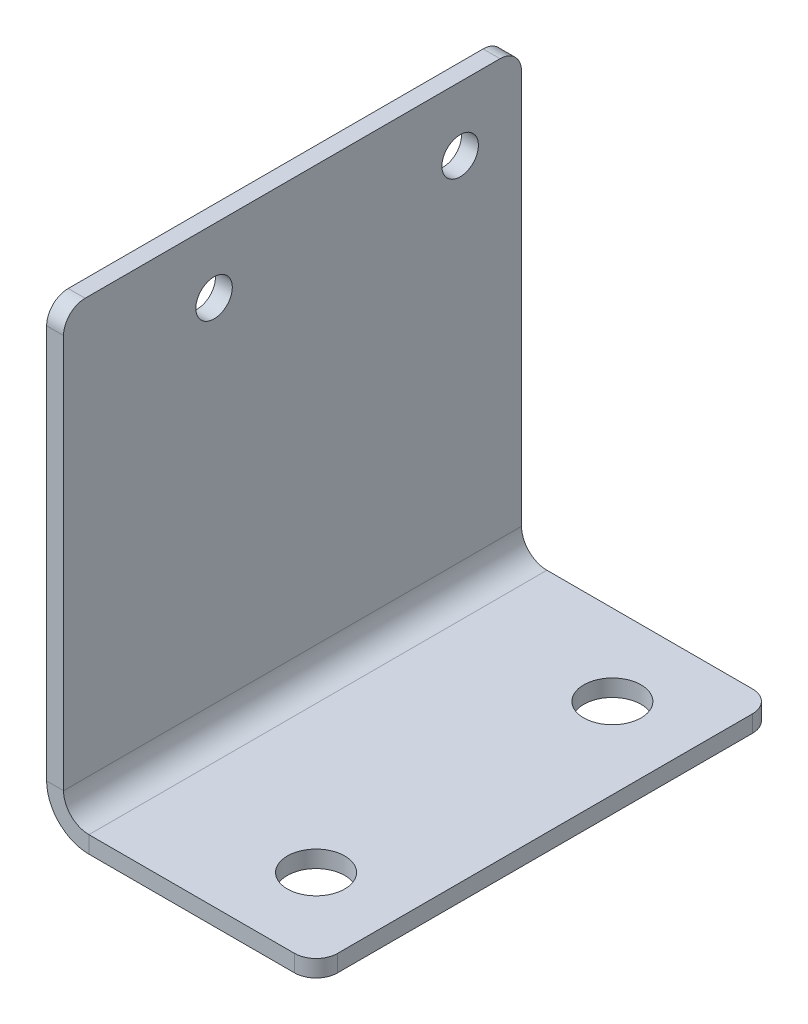
ISO-10303-21;
HEADER;
FILE_DESCRIPTION(('STEP AP214'),'2;1');
FILE_NAME('part.step','',(''),(''),'','','');
FILE_SCHEMA(('AUTOMOTIVE_DESIGN { 1 0 10303 214 1 1 1 1 }'));
ENDSEC;
DATA;
#1=APPLICATION_CONTEXT('core data for automotive mechanical design processes');
#2=APPLICATION_PROTOCOL_DEFINITION('international standard','automotive_design',2000,#1);
#3=PRODUCT_CONTEXT('',#1,'mechanical');
#4=PRODUCT('Part','Part','',(#3));
#5=PRODUCT_RELATED_PRODUCT_CATEGORY('part','',(#4));
#6=PRODUCT_DEFINITION_FORMATION('','',#4);
#7=PRODUCT_DEFINITION_CONTEXT('part definition',#1,'design');
#8=PRODUCT_DEFINITION('design','',#6,#7);
#9=PRODUCT_DEFINITION_SHAPE('','',#8);
#10=(LENGTH_UNIT() NAMED_UNIT(*) SI_UNIT(.MILLI.,.METRE.));
#11=(NAMED_UNIT(*) PLANE_ANGLE_UNIT() SI_UNIT($,.RADIAN.));
#12=(NAMED_UNIT(*) SI_UNIT($,.STERADIAN.) SOLID_ANGLE_UNIT());
#13=UNCERTAINTY_MEASURE_WITH_UNIT(LENGTH_MEASURE(1.E-05),#10,'distance_accuracy_value','');
#14=(GEOMETRIC_REPRESENTATION_CONTEXT(3) GLOBAL_UNCERTAINTY_ASSIGNED_CONTEXT((#13)) GLOBAL_UNIT_ASSIGNED_CONTEXT((#10,
#11,#12)) REPRESENTATION_CONTEXT('',''));
#15=CARTESIAN_POINT('',(0.,0.,0.));
#16=DIRECTION('',(0.,0.,1.));
#17=DIRECTION('',(1.,0.,0.));
#18=AXIS2_PLACEMENT_3D('',#15,#16,#17);
#19=CARTESIAN_POINT('',(0.,4.98475,53.975));
#20=DIRECTION('',(0.,0.,1.));
#21=DIRECTION('',(1.,0.,0.));
#22=AXIS2_PLACEMENT_3D('',#19,#20,#21);
#23=PLANE('',#22);
#24=DIRECTION('',(1.,0.,0.));
#25=VECTOR('',#24,1.);
#26=CARTESIAN_POINT('',(0.,4.98475,53.975));
#27=LINE('',#26,#25);
#28=CARTESIAN_POINT('',(0.,4.98475,53.975));
#29=VERTEX_POINT('',#28);
#30=CARTESIAN_POINT('',(1.9939,4.98475,53.975));
#31=VERTEX_POINT('',#30);
#32=EDGE_CURVE('E140',#29,#31,#27,.T.);
#33=ORIENTED_EDGE('',*,*,#32,.F.);
#34=CARTESIAN_POINT('',(4.98475,4.98475,53.975));
#35=DIRECTION('',(0.,0.,-1.));
#36=DIRECTION('',(-1.,0.,0.));
#37=AXIS2_PLACEMENT_3D('',#34,#35,#36);
#38=CIRCLE('',#37,4.98475);
#39=CARTESIAN_POINT('',(4.98475,0.,53.975));
#40=VERTEX_POINT('',#39);
#41=EDGE_CURVE('E135',#29,#40,#38,.F.);
#42=ORIENTED_EDGE('',*,*,#41,.T.);
#43=DIRECTION('',(0.,-1.,0.));
#44=VECTOR('',#43,1.);
#45=CARTESIAN_POINT('',(4.98475,1.9939,53.975));
#46=LINE('',#45,#44);
#47=CARTESIAN_POINT('',(4.98475,1.9939,53.975));
#48=VERTEX_POINT('',#47);
#49=EDGE_CURVE('E129',#48,#40,#46,.T.);
#50=ORIENTED_EDGE('',*,*,#49,.F.);
#51=CARTESIAN_POINT('',(4.98475,4.98475,53.975));
#52=DIRECTION('',(0.,0.,1.));
#53=DIRECTION('',(1.,0.,0.));
#54=AXIS2_PLACEMENT_3D('',#51,#52,#53);
#55=CIRCLE('',#54,2.99085);
#56=EDGE_CURVE('E133',#31,#48,#55,.T.);
#57=ORIENTED_EDGE('',*,*,#56,.F.);
#58=EDGE_LOOP('',(#33,#42,#50,#57));
#59=FACE_BOUND('',#58,.T.);
#60=ADVANCED_FACE('F38',(#59),#23,.T.);
#61=CARTESIAN_POINT('',(4.98475,1.9939,53.975));
#62=DIRECTION('',(0.,0.,1.));
#63=DIRECTION('',(1.,0.,0.));
#64=AXIS2_PLACEMENT_3D('',#61,#62,#63);
#65=PLANE('',#64);
#66=DIRECTION('',(0.,-1.,0.));
#67=VECTOR('',#66,1.);
#68=CARTESIAN_POINT('',(1.9939,53.975,53.975));
#69=LINE('',#68,#67);
#70=CARTESIAN_POINT('',(1.9939,51.435,53.975));
#71=VERTEX_POINT('',#70);
#72=EDGE_CURVE('E167',#71,#31,#69,.T.);
#73=ORIENTED_EDGE('',*,*,#72,.F.);
#74=DIRECTION('',(1.,0.,0.));
#75=VECTOR('',#74,1.);
#76=CARTESIAN_POINT('',(4.98475,51.435,53.975));
#77=LINE('',#76,#75);
#78=CARTESIAN_POINT('',(0.,51.435,53.975));
#79=VERTEX_POINT('',#78);
#80=EDGE_CURVE('E61',#71,#79,#77,.F.);
#81=ORIENTED_EDGE('',*,*,#80,.T.);
#82=DIRECTION('',(0.,-1.,0.));
#83=VECTOR('',#82,1.);
#84=CARTESIAN_POINT('',(0.,53.975,53.975));
#85=LINE('',#84,#83);
#86=EDGE_CURVE('E169',#79,#29,#85,.T.);
#87=ORIENTED_EDGE('',*,*,#86,.T.);
#88=ORIENTED_EDGE('',*,*,#32,.T.);
#89=EDGE_LOOP('',(#73,#81,#87,#88));
#90=FACE_BOUND('',#89,.T.);
#91=ADVANCED_FACE('F252',(#90),#65,.T.);
#92=CARTESIAN_POINT('',(4.98475,0.,0.));
#93=DIRECTION('',(0.,0.,-1.));
#94=DIRECTION('',(-1.,0.,0.));
#95=AXIS2_PLACEMENT_3D('',#92,#93,#94);
#96=PLANE('',#95);
#97=DIRECTION('',(0.,1.,0.));
#98=VECTOR('',#97,1.);
#99=CARTESIAN_POINT('',(4.98475,0.,0.));
#100=LINE('',#99,#98);
#101=CARTESIAN_POINT('',(4.98475,0.,0.));
#102=VERTEX_POINT('',#101);
#103=CARTESIAN_POINT('',(4.98475,1.9939,0.));
#104=VERTEX_POINT('',#103);
#105=EDGE_CURVE('E141',#102,#104,#100,.T.);
#106=ORIENTED_EDGE('',*,*,#105,.F.);
#107=CARTESIAN_POINT('',(4.98475,4.98475,0.));
#108=DIRECTION('',(0.,0.,-1.));
#109=DIRECTION('',(-1.,0.,0.));
#110=AXIS2_PLACEMENT_3D('',#107,#108,#109);
#111=CIRCLE('',#110,4.98475);
#112=CARTESIAN_POINT('',(0.,4.98475,0.));
#113=VERTEX_POINT('',#112);
#114=EDGE_CURVE('E187',#113,#102,#111,.F.);
#115=ORIENTED_EDGE('',*,*,#114,.F.);
#116=DIRECTION('',(-1.,0.,0.));
#117=VECTOR('',#116,1.);
#118=CARTESIAN_POINT('',(1.9939,4.98475,0.));
#119=LINE('',#118,#117);
#120=CARTESIAN_POINT('',(1.9939,4.98475,0.));
#121=VERTEX_POINT('',#120);
#122=EDGE_CURVE('E206',#121,#113,#119,.T.);
#123=ORIENTED_EDGE('',*,*,#122,.F.);
#124=CARTESIAN_POINT('',(4.98475,4.98475,0.));
#125=DIRECTION('',(0.,0.,1.));
#126=DIRECTION('',(1.,0.,0.));
#127=AXIS2_PLACEMENT_3D('',#124,#125,#126);
#128=CIRCLE('',#127,2.99085);
#129=EDGE_CURVE('E181',#121,#104,#128,.T.);
#130=ORIENTED_EDGE('',*,*,#129,.T.);
#131=EDGE_LOOP('',(#106,#115,#123,#130));
#132=FACE_BOUND('',#131,.T.);
#133=ADVANCED_FACE('F315',(#132),#96,.T.);
#134=CARTESIAN_POINT('',(1.9939,4.98475,0.));
#135=DIRECTION('',(0.,0.,-1.));
#136=DIRECTION('',(-1.,0.,0.));
#137=AXIS2_PLACEMENT_3D('',#134,#135,#136);
#138=PLANE('',#137);
#139=DIRECTION('',(1.,0.,0.));
#140=VECTOR('',#139,1.);
#141=CARTESIAN_POINT('',(0.,1.9939,0.));
#142=LINE('',#141,#140);
#143=CARTESIAN_POINT('',(29.21,1.9939,0.));
#144=VERTEX_POINT('',#143);
#145=EDGE_CURVE('E152',#104,#144,#142,.T.);
#146=ORIENTED_EDGE('',*,*,#145,.T.);
#147=DIRECTION('',(0.,-1.,0.));
#148=VECTOR('',#147,1.);
#149=CARTESIAN_POINT('',(29.21,4.98475,0.));
#150=LINE('',#149,#148);
#151=CARTESIAN_POINT('',(29.21,0.,0.));
#152=VERTEX_POINT('',#151);
#153=EDGE_CURVE('E226',#144,#152,#150,.T.);
#154=ORIENTED_EDGE('',*,*,#153,.T.);
#155=DIRECTION('',(1.,0.,0.));
#156=VECTOR('',#155,1.);
#157=CARTESIAN_POINT('',(0.,0.,0.));
#158=LINE('',#157,#156);
#159=EDGE_CURVE('E176',#102,#152,#158,.T.);
#160=ORIENTED_EDGE('',*,*,#159,.F.);
#161=ORIENTED_EDGE('',*,*,#105,.T.);
#162=EDGE_LOOP('',(#146,#154,#160,#161));
#163=FACE_BOUND('',#162,.T.);
#164=ADVANCED_FACE('F339',(#163),#138,.T.);
#165=CARTESIAN_POINT('',(0.,0.,53.975));
#166=DIRECTION('',(0.,1.,0.));
#167=DIRECTION('',(0.,0.,1.));
#168=AXIS2_PLACEMENT_3D('',#165,#166,#167);
#169=PLANE('',#168);
#170=CARTESIAN_POINT('',(22.225,0.,44.45));
#171=DIRECTION('',(0.,1.,0.));
#172=DIRECTION('',(0.,0.,1.));
#173=AXIS2_PLACEMENT_3D('',#170,#171,#172);
#174=CIRCLE('',#173,3.3782);
#175=CARTESIAN_POINT('',(22.225,0.,47.8282));
#176=VERTEX_POINT('',#175);
#177=EDGE_CURVE('E279',#176,#176,#174,.T.);
#178=ORIENTED_EDGE('',*,*,#177,.T.);
#179=EDGE_LOOP('',(#178));
#180=FACE_BOUND('',#179,.T.);
#181=CARTESIAN_POINT('',(22.225,0.,9.52499999999999));
#182=DIRECTION('',(0.,1.,0.));
#183=DIRECTION('',(0.,0.,1.));
#184=AXIS2_PLACEMENT_3D('',#181,#182,#183);
#185=CIRCLE('',#184,3.3782);
#186=CARTESIAN_POINT('',(22.225,0.,12.9032));
#187=VERTEX_POINT('',#186);
#188=EDGE_CURVE('E273',#187,#187,#185,.T.);
#189=ORIENTED_EDGE('',*,*,#188,.T.);
#190=EDGE_LOOP('',(#189));
#191=FACE_BOUND('',#190,.T.);
#192=DIRECTION('',(0.,0.,-1.));
#193=VECTOR('',#192,1.);
#194=CARTESIAN_POINT('',(31.75,0.,53.975));
#195=LINE('',#194,#193);
#196=CARTESIAN_POINT('',(31.75,0.,51.435));
#197=VERTEX_POINT('',#196);
#198=CARTESIAN_POINT('',(31.75,0.,2.54));
#199=VERTEX_POINT('',#198);
#200=EDGE_CURVE('E203',#197,#199,#195,.T.);
#201=ORIENTED_EDGE('',*,*,#200,.F.);
#202=CARTESIAN_POINT('',(29.21,0.,51.435));
#203=DIRECTION('',(0.,1.,0.));
#204=DIRECTION('',(0.,0.,1.));
#205=AXIS2_PLACEMENT_3D('',#202,#203,#204);
#206=CIRCLE('',#205,2.54);
#207=CARTESIAN_POINT('',(29.21,0.,53.975));
#208=VERTEX_POINT('',#207);
#209=EDGE_CURVE('E219',#197,#208,#206,.F.);
#210=ORIENTED_EDGE('',*,*,#209,.T.);
#211=DIRECTION('',(1.,0.,0.));
#212=VECTOR('',#211,1.);
#213=CARTESIAN_POINT('',(0.,0.,53.975));
#214=LINE('',#213,#212);
#215=EDGE_CURVE('E162',#40,#208,#214,.T.);
#216=ORIENTED_EDGE('',*,*,#215,.F.);
#217=DIRECTION('',(0.,0.,-1.));
#218=VECTOR('',#217,1.);
#219=CARTESIAN_POINT('',(4.98475,0.,53.975));
#220=LINE('',#219,#218);
#221=EDGE_CURVE('E175',#40,#102,#220,.T.);
#222=ORIENTED_EDGE('',*,*,#221,.T.);
#223=ORIENTED_EDGE('',*,*,#159,.T.);
#224=CARTESIAN_POINT('',(29.21,0.,2.54));
#225=DIRECTION('',(0.,1.,0.));
#226=DIRECTION('',(0.,0.,1.));
#227=AXIS2_PLACEMENT_3D('',#224,#225,#226);
#228=CIRCLE('',#227,2.54);
#229=EDGE_CURVE('E217',#152,#199,#228,.F.);
#230=ORIENTED_EDGE('',*,*,#229,.T.);
#231=EDGE_LOOP('',(#201,#210,#216,#222,#223,#230));
#232=FACE_BOUND('',#231,.T.);
#233=ADVANCED_FACE('F260',(#180,#191,#232),#169,.F.);
#234=CARTESIAN_POINT('',(31.75,1.9939,53.975));
#235=DIRECTION('',(1.,0.,0.));
#236=DIRECTION('',(0.,0.,-1.));
#237=AXIS2_PLACEMENT_3D('',#234,#235,#236);
#238=PLANE('',#237);
#239=DIRECTION('',(0.,0.,-1.));
#240=VECTOR('',#239,1.);
#241=CARTESIAN_POINT('',(31.75,1.9939,53.975));
#242=LINE('',#241,#240);
#243=CARTESIAN_POINT('',(31.75,1.9939,51.435));
#244=VERTEX_POINT('',#243);
#245=CARTESIAN_POINT('',(31.75,1.9939,2.54));
#246=VERTEX_POINT('',#245);
#247=EDGE_CURVE('E156',#244,#246,#242,.T.);
#248=ORIENTED_EDGE('',*,*,#247,.F.);
#249=DIRECTION('',(0.,-1.,0.));
#250=VECTOR('',#249,1.);
#251=CARTESIAN_POINT('',(31.75,1.9939,51.435));
#252=LINE('',#251,#250);
#253=EDGE_CURVE('E214',#244,#197,#252,.T.);
#254=ORIENTED_EDGE('',*,*,#253,.T.);
#255=ORIENTED_EDGE('',*,*,#200,.T.);
#256=DIRECTION('',(0.,-1.,0.));
#257=VECTOR('',#256,1.);
#258=CARTESIAN_POINT('',(31.75,1.9939,2.54));
#259=LINE('',#258,#257);
#260=EDGE_CURVE('E212',#199,#246,#259,.F.);
#261=ORIENTED_EDGE('',*,*,#260,.T.);
#262=EDGE_LOOP('',(#248,#254,#255,#261));
#263=FACE_BOUND('',#262,.T.);
#264=ADVANCED_FACE('F290',(#263),#238,.T.);
#265=CARTESIAN_POINT('',(0.,1.9939,53.975));
#266=DIRECTION('',(0.,1.,0.));
#267=DIRECTION('',(0.,0.,1.));
#268=AXIS2_PLACEMENT_3D('',#265,#266,#267);
#269=PLANE('',#268);
#270=CARTESIAN_POINT('',(22.225,1.9939,44.45));
#271=DIRECTION('',(0.,1.,0.));
#272=DIRECTION('',(0.,0.,1.));
#273=AXIS2_PLACEMENT_3D('',#270,#271,#272);
#274=CIRCLE('',#273,3.37819999999997);
#275=CARTESIAN_POINT('',(22.225,1.9939,47.8282));
#276=VERTEX_POINT('',#275);
#277=EDGE_CURVE('E282',#276,#276,#274,.T.);
#278=ORIENTED_EDGE('',*,*,#277,.F.);
#279=EDGE_LOOP('',(#278));
#280=FACE_BOUND('',#279,.T.);
#281=CARTESIAN_POINT('',(22.225,1.9939,9.52499999999999));
#282=DIRECTION('',(0.,1.,0.));
#283=DIRECTION('',(0.,0.,1.));
#284=AXIS2_PLACEMENT_3D('',#281,#282,#283);
#285=CIRCLE('',#284,3.37819999999997);
#286=CARTESIAN_POINT('',(22.225,1.9939,12.9032));
#287=VERTEX_POINT('',#286);
#288=EDGE_CURVE('E276',#287,#287,#285,.T.);
#289=ORIENTED_EDGE('',*,*,#288,.F.);
#290=EDGE_LOOP('',(#289));
#291=FACE_BOUND('',#290,.T.);
#292=DIRECTION('',(1.,0.,0.));
#293=VECTOR('',#292,1.);
#294=CARTESIAN_POINT('',(0.,1.9939,53.975));
#295=LINE('',#294,#293);
#296=CARTESIAN_POINT('',(29.21,1.9939,53.975));
#297=VERTEX_POINT('',#296);
#298=EDGE_CURVE('E149',#48,#297,#295,.T.);
#299=ORIENTED_EDGE('',*,*,#298,.T.);
#300=CARTESIAN_POINT('',(29.21,1.9939,51.435));
#301=DIRECTION('',(0.,1.,0.));
#302=DIRECTION('',(0.,0.,1.));
#303=AXIS2_PLACEMENT_3D('',#300,#301,#302);
#304=CIRCLE('',#303,2.54);
#305=EDGE_CURVE('E224',#297,#244,#304,.T.);
#306=ORIENTED_EDGE('',*,*,#305,.T.);
#307=ORIENTED_EDGE('',*,*,#247,.T.);
#308=CARTESIAN_POINT('',(29.21,1.9939,2.54));
#309=DIRECTION('',(0.,1.,0.));
#310=DIRECTION('',(0.,0.,1.));
#311=AXIS2_PLACEMENT_3D('',#308,#309,#310);
#312=CIRCLE('',#311,2.54);
#313=EDGE_CURVE('E222',#246,#144,#312,.T.);
#314=ORIENTED_EDGE('',*,*,#313,.T.);
#315=ORIENTED_EDGE('',*,*,#145,.F.);
#316=DIRECTION('',(0.,0.,-1.));
#317=VECTOR('',#316,1.);
#318=CARTESIAN_POINT('',(4.98475,1.9939,53.975));
#319=LINE('',#318,#317);
#320=EDGE_CURVE('E147',#48,#104,#319,.T.);
#321=ORIENTED_EDGE('',*,*,#320,.F.);
#322=EDGE_LOOP('',(#299,#306,#307,#314,#315,#321));
#323=FACE_BOUND('',#322,.T.);
#324=ADVANCED_FACE('F148',(#280,#291,#323),#269,.T.);
#325=CARTESIAN_POINT('',(4.98475,4.98475,53.975));
#326=DIRECTION('',(0.,0.,-1.));
#327=DIRECTION('',(-1.,0.,0.));
#328=AXIS2_PLACEMENT_3D('',#325,#326,#327);
#329=CYLINDRICAL_SURFACE('',#328,2.99085);
#330=ORIENTED_EDGE('',*,*,#129,.F.);
#331=DIRECTION('',(0.,0.,-1.));
#332=VECTOR('',#331,1.);
#333=CARTESIAN_POINT('',(1.9939,4.98475,53.975));
#334=LINE('',#333,#332);
#335=EDGE_CURVE('E157',#31,#121,#334,.T.);
#336=ORIENTED_EDGE('',*,*,#335,.F.);
#337=ORIENTED_EDGE('',*,*,#56,.T.);
#338=ORIENTED_EDGE('',*,*,#320,.T.);
#339=EDGE_LOOP('',(#330,#336,#337,#338));
#340=FACE_BOUND('',#339,.T.);
#341=ADVANCED_FACE('F165',(#340),#329,.F.);
#342=CARTESIAN_POINT('',(1.9939,53.975,53.975));
#343=DIRECTION('',(1.,0.,0.));
#344=DIRECTION('',(0.,1.,0.));
#345=AXIS2_PLACEMENT_3D('',#342,#343,#344);
#346=PLANE('',#345);
#347=CARTESIAN_POINT('',(1.9939,46.419,36.2375));
#348=DIRECTION('',(1.,0.,0.));
#349=DIRECTION('',(0.,1.,0.));
#350=AXIS2_PLACEMENT_3D('',#347,#348,#349);
#351=CIRCLE('',#350,2.14999999999997);
#352=CARTESIAN_POINT('',(1.9939,48.569,36.2375));
#353=VERTEX_POINT('',#352);
#354=EDGE_CURVE('E267',#353,#353,#351,.T.);
#355=ORIENTED_EDGE('',*,*,#354,.F.);
#356=EDGE_LOOP('',(#355));
#357=FACE_BOUND('',#356,.T.);
#358=CARTESIAN_POINT('',(1.9939,46.419,7.23749992200001));
#359=DIRECTION('',(1.,0.,0.));
#360=DIRECTION('',(0.,1.,0.));
#361=AXIS2_PLACEMENT_3D('',#358,#359,#360);
#362=CIRCLE('',#361,2.14999999999997);
#363=CARTESIAN_POINT('',(1.9939,48.569,7.23749992200001));
#364=VERTEX_POINT('',#363);
#365=EDGE_CURVE('E179',#364,#364,#362,.T.);
#366=ORIENTED_EDGE('',*,*,#365,.F.);
#367=EDGE_LOOP('',(#366));
#368=FACE_BOUND('',#367,.T.);
#369=DIRECTION('',(0.,0.,-1.));
#370=VECTOR('',#369,1.);
#371=CARTESIAN_POINT('',(1.9939,53.975,53.975));
#372=LINE('',#371,#370);
#373=CARTESIAN_POINT('',(1.9939,53.975,51.435));
#374=VERTEX_POINT('',#373);
#375=CARTESIAN_POINT('',(1.9939,53.975,2.54));
#376=VERTEX_POINT('',#375);
#377=EDGE_CURVE('E197',#374,#376,#372,.T.);
#378=ORIENTED_EDGE('',*,*,#377,.F.);
#379=CARTESIAN_POINT('',(1.9939,51.435,51.435));
#380=DIRECTION('',(1.,0.,0.));
#381=DIRECTION('',(0.,1.,0.));
#382=AXIS2_PLACEMENT_3D('',#379,#380,#381);
#383=CIRCLE('',#382,2.54);
#384=EDGE_CURVE('E236',#374,#71,#383,.T.);
#385=ORIENTED_EDGE('',*,*,#384,.T.);
#386=ORIENTED_EDGE('',*,*,#72,.T.);
#387=ORIENTED_EDGE('',*,*,#335,.T.);
#388=DIRECTION('',(0.,-1.,0.));
#389=VECTOR('',#388,1.);
#390=CARTESIAN_POINT('',(1.9939,53.975,0.));
#391=LINE('',#390,#389);
#392=CARTESIAN_POINT('',(1.9939,51.435,0.));
#393=VERTEX_POINT('',#392);
#394=EDGE_CURVE('E183',#393,#121,#391,.T.);
#395=ORIENTED_EDGE('',*,*,#394,.F.);
#396=CARTESIAN_POINT('',(1.9939,51.435,2.54));
#397=DIRECTION('',(1.,0.,0.));
#398=DIRECTION('',(0.,1.,0.));
#399=AXIS2_PLACEMENT_3D('',#396,#397,#398);
#400=CIRCLE('',#399,2.54);
#401=EDGE_CURVE('E234',#393,#376,#400,.T.);
#402=ORIENTED_EDGE('',*,*,#401,.T.);
#403=EDGE_LOOP('',(#378,#385,#386,#387,#395,#402));
#404=FACE_BOUND('',#403,.T.);
#405=ADVANCED_FACE('F251',(#357,#368,#404),#346,.T.);
#406=CARTESIAN_POINT('',(0.,53.975,53.975));
#407=DIRECTION('',(0.,1.,0.));
#408=DIRECTION('',(0.,0.,1.));
#409=AXIS2_PLACEMENT_3D('',#406,#407,#408);
#410=PLANE('',#409);
#411=DIRECTION('',(0.,0.,-1.));
#412=VECTOR('',#411,1.);
#413=CARTESIAN_POINT('',(0.,53.975,53.975));
#414=LINE('',#413,#412);
#415=CARTESIAN_POINT('',(0.,53.975,51.435));
#416=VERTEX_POINT('',#415);
#417=CARTESIAN_POINT('',(0.,53.975,2.54));
#418=VERTEX_POINT('',#417);
#419=EDGE_CURVE('E195',#416,#418,#414,.T.);
#420=ORIENTED_EDGE('',*,*,#419,.F.);
#421=DIRECTION('',(1.,0.,0.));
#422=VECTOR('',#421,1.);
#423=CARTESIAN_POINT('',(0.,53.975,51.435));
#424=LINE('',#423,#422);
#425=EDGE_CURVE('E231',#416,#374,#424,.T.);
#426=ORIENTED_EDGE('',*,*,#425,.T.);
#427=ORIENTED_EDGE('',*,*,#377,.T.);
#428=DIRECTION('',(1.,0.,0.));
#429=VECTOR('',#428,1.);
#430=CARTESIAN_POINT('',(0.,53.975,2.54));
#431=LINE('',#430,#429);
#432=EDGE_CURVE('E229',#376,#418,#431,.F.);
#433=ORIENTED_EDGE('',*,*,#432,.T.);
#434=EDGE_LOOP('',(#420,#426,#427,#433));
#435=FACE_BOUND('',#434,.T.);
#436=ADVANCED_FACE('F246',(#435),#410,.T.);
#437=CARTESIAN_POINT('',(0.,53.975,53.975));
#438=DIRECTION('',(1.,0.,0.));
#439=DIRECTION('',(0.,1.,0.));
#440=AXIS2_PLACEMENT_3D('',#437,#438,#439);
#441=PLANE('',#440);
#442=CARTESIAN_POINT('',(0.,46.419,36.2375));
#443=DIRECTION('',(-1.,0.,0.));
#444=DIRECTION('',(0.,0.,1.));
#445=AXIS2_PLACEMENT_3D('',#442,#443,#444);
#446=CIRCLE('',#445,2.14999999999997);
#447=CARTESIAN_POINT('',(0.,46.419,38.3875));
#448=VERTEX_POINT('',#447);
#449=EDGE_CURVE('E270',#448,#448,#446,.T.);
#450=ORIENTED_EDGE('',*,*,#449,.F.);
#451=EDGE_LOOP('',(#450));
#452=FACE_BOUND('',#451,.T.);
#453=CARTESIAN_POINT('',(0.,46.419,7.23749992200001));
#454=DIRECTION('',(-1.,0.,0.));
#455=DIRECTION('',(0.,0.,1.));
#456=AXIS2_PLACEMENT_3D('',#453,#454,#455);
#457=CIRCLE('',#456,2.14999999999997);
#458=CARTESIAN_POINT('',(0.,46.419,9.38749992199998));
#459=VERTEX_POINT('',#458);
#460=EDGE_CURVE('E264',#459,#459,#457,.T.);
#461=ORIENTED_EDGE('',*,*,#460,.F.);
#462=EDGE_LOOP('',(#461));
#463=FACE_BOUND('',#462,.T.);
#464=ORIENTED_EDGE('',*,*,#86,.F.);
#465=CARTESIAN_POINT('',(0.,51.435,51.435));
#466=DIRECTION('',(1.,0.,0.));
#467=DIRECTION('',(0.,1.,0.));
#468=AXIS2_PLACEMENT_3D('',#465,#466,#467);
#469=CIRCLE('',#468,2.54);
#470=EDGE_CURVE('E46',#79,#416,#469,.F.);
#471=ORIENTED_EDGE('',*,*,#470,.T.);
#472=ORIENTED_EDGE('',*,*,#419,.T.);
#473=CARTESIAN_POINT('',(0.,51.435,2.54));
#474=DIRECTION('',(1.,0.,0.));
#475=DIRECTION('',(0.,1.,0.));
#476=AXIS2_PLACEMENT_3D('',#473,#474,#475);
#477=CIRCLE('',#476,2.54);
#478=CARTESIAN_POINT('',(0.,51.435,0.));
#479=VERTEX_POINT('',#478);
#480=EDGE_CURVE('E53',#418,#479,#477,.F.);
#481=ORIENTED_EDGE('',*,*,#480,.T.);
#482=DIRECTION('',(0.,-1.,0.));
#483=VECTOR('',#482,1.);
#484=CARTESIAN_POINT('',(0.,53.975,0.));
#485=LINE('',#484,#483);
#486=EDGE_CURVE('E185',#479,#113,#485,.T.);
#487=ORIENTED_EDGE('',*,*,#486,.T.);
#488=DIRECTION('',(0.,0.,-1.));
#489=VECTOR('',#488,1.);
#490=CARTESIAN_POINT('',(0.,4.98475,53.975));
#491=LINE('',#490,#489);
#492=EDGE_CURVE('E192',#29,#113,#491,.T.);
#493=ORIENTED_EDGE('',*,*,#492,.F.);
#494=EDGE_LOOP('',(#464,#471,#472,#481,#487,#493));
#495=FACE_BOUND('',#494,.T.);
#496=ADVANCED_FACE('F241',(#452,#463,#495),#441,.F.);
#497=CARTESIAN_POINT('',(4.98475,4.98475,53.975));
#498=DIRECTION('',(0.,0.,-1.));
#499=DIRECTION('',(-1.,0.,0.));
#500=AXIS2_PLACEMENT_3D('',#497,#498,#499);
#501=CYLINDRICAL_SURFACE('',#500,4.98475);
#502=ORIENTED_EDGE('',*,*,#114,.T.);
#503=ORIENTED_EDGE('',*,*,#221,.F.);
#504=ORIENTED_EDGE('',*,*,#41,.F.);
#505=ORIENTED_EDGE('',*,*,#492,.T.);
#506=EDGE_LOOP('',(#502,#503,#504,#505));
#507=FACE_BOUND('',#506,.T.);
#508=ADVANCED_FACE('F255',(#507),#501,.T.);
#509=CARTESIAN_POINT('',(4.98475,4.98475,53.975));
#510=DIRECTION('',(0.,0.,1.));
#511=DIRECTION('',(1.,0.,0.));
#512=AXIS2_PLACEMENT_3D('',#509,#510,#511);
#513=PLANE('',#512);
#514=ORIENTED_EDGE('',*,*,#215,.T.);
#515=DIRECTION('',(0.,-1.,0.));
#516=VECTOR('',#515,1.);
#517=CARTESIAN_POINT('',(29.21,4.98475,53.975));
#518=LINE('',#517,#516);
#519=EDGE_CURVE('E161',#208,#297,#518,.F.);
#520=ORIENTED_EDGE('',*,*,#519,.T.);
#521=ORIENTED_EDGE('',*,*,#298,.F.);
#522=ORIENTED_EDGE('',*,*,#49,.T.);
#523=EDGE_LOOP('',(#514,#520,#521,#522));
#524=FACE_BOUND('',#523,.T.);
#525=ADVANCED_FACE('F159',(#524),#513,.T.);
#526=CARTESIAN_POINT('',(4.98475,4.98475,0.));
#527=DIRECTION('',(0.,0.,1.));
#528=DIRECTION('',(1.,0.,0.));
#529=AXIS2_PLACEMENT_3D('',#526,#527,#528);
#530=PLANE('',#529);
#531=ORIENTED_EDGE('',*,*,#486,.F.);
#532=DIRECTION('',(1.,0.,0.));
#533=VECTOR('',#532,1.);
#534=CARTESIAN_POINT('',(1.9939,51.435,0.));
#535=LINE('',#534,#533);
#536=EDGE_CURVE('E11',#479,#393,#535,.T.);
#537=ORIENTED_EDGE('',*,*,#536,.T.);
#538=ORIENTED_EDGE('',*,*,#394,.T.);
#539=ORIENTED_EDGE('',*,*,#122,.T.);
#540=EDGE_LOOP('',(#531,#537,#538,#539));
#541=FACE_BOUND('',#540,.T.);
#542=ADVANCED_FACE('F335',(#541),#530,.F.);
#543=CARTESIAN_POINT('',(0.,46.419,7.23749992200001));
#544=DIRECTION('',(-1.,0.,0.));
#545=DIRECTION('',(0.,0.,1.));
#546=AXIS2_PLACEMENT_3D('',#543,#544,#545);
#547=CYLINDRICAL_SURFACE('',#546,2.14999999999997);
#548=ORIENTED_EDGE('',*,*,#365,.T.);
#549=EDGE_LOOP('',(#548));
#550=FACE_BOUND('',#549,.T.);
#551=ORIENTED_EDGE('',*,*,#460,.T.);
#552=EDGE_LOOP('',(#551));
#553=FACE_BOUND('',#552,.T.);
#554=ADVANCED_FACE('F306',(#550,#553),#547,.F.);
#555=CARTESIAN_POINT('',(0.,46.419,36.2375));
#556=DIRECTION('',(-1.,0.,0.));
#557=DIRECTION('',(0.,0.,1.));
#558=AXIS2_PLACEMENT_3D('',#555,#556,#557);
#559=CYLINDRICAL_SURFACE('',#558,2.14999999999997);
#560=ORIENTED_EDGE('',*,*,#354,.T.);
#561=EDGE_LOOP('',(#560));
#562=FACE_BOUND('',#561,.T.);
#563=ORIENTED_EDGE('',*,*,#449,.T.);
#564=EDGE_LOOP('',(#563));
#565=FACE_BOUND('',#564,.T.);
#566=ADVANCED_FACE('F296',(#562,#565),#559,.F.);
#567=CARTESIAN_POINT('',(22.225,1.9939,9.52499999999999));
#568=DIRECTION('',(0.,1.,0.));
#569=DIRECTION('',(0.,0.,1.));
#570=AXIS2_PLACEMENT_3D('',#567,#568,#569);
#571=CYLINDRICAL_SURFACE('',#570,3.37819999999999);
#572=ORIENTED_EDGE('',*,*,#188,.F.);
#573=EDGE_LOOP('',(#572));
#574=FACE_BOUND('',#573,.T.);
#575=ORIENTED_EDGE('',*,*,#288,.T.);
#576=EDGE_LOOP('',(#575));
#577=FACE_BOUND('',#576,.T.);
#578=ADVANCED_FACE('F294',(#574,#577),#571,.F.);
#579=CARTESIAN_POINT('',(22.225,1.9939,44.45));
#580=DIRECTION('',(0.,1.,0.));
#581=DIRECTION('',(0.,0.,1.));
#582=AXIS2_PLACEMENT_3D('',#579,#580,#581);
#583=CYLINDRICAL_SURFACE('',#582,3.37819999999998);
#584=ORIENTED_EDGE('',*,*,#177,.F.);
#585=EDGE_LOOP('',(#584));
#586=FACE_BOUND('',#585,.T.);
#587=ORIENTED_EDGE('',*,*,#277,.T.);
#588=EDGE_LOOP('',(#587));
#589=FACE_BOUND('',#588,.T.);
#590=ADVANCED_FACE('F286',(#586,#589),#583,.F.);
#591=CARTESIAN_POINT('',(29.21,1.9939,51.435));
#592=DIRECTION('',(0.,-1.,0.));
#593=DIRECTION('',(0.,0.,-1.));
#594=AXIS2_PLACEMENT_3D('',#591,#592,#593);
#595=CYLINDRICAL_SURFACE('',#594,2.54);
#596=ORIENTED_EDGE('',*,*,#305,.F.);
#597=ORIENTED_EDGE('',*,*,#519,.F.);
#598=ORIENTED_EDGE('',*,*,#209,.F.);
#599=ORIENTED_EDGE('',*,*,#253,.F.);
#600=EDGE_LOOP('',(#596,#597,#598,#599));
#601=FACE_BOUND('',#600,.T.);
#602=ADVANCED_FACE('F303',(#601),#595,.T.);
#603=CARTESIAN_POINT('',(29.21,4.98475,2.54));
#604=DIRECTION('',(0.,-1.,0.));
#605=DIRECTION('',(0.,0.,-1.));
#606=AXIS2_PLACEMENT_3D('',#603,#604,#605);
#607=CYLINDRICAL_SURFACE('',#606,2.54);
#608=ORIENTED_EDGE('',*,*,#313,.F.);
#609=ORIENTED_EDGE('',*,*,#260,.F.);
#610=ORIENTED_EDGE('',*,*,#229,.F.);
#611=ORIENTED_EDGE('',*,*,#153,.F.);
#612=EDGE_LOOP('',(#608,#609,#610,#611));
#613=FACE_BOUND('',#612,.T.);
#614=ADVANCED_FACE('F321',(#613),#607,.T.);
#615=CARTESIAN_POINT('',(0.,51.435,51.435));
#616=DIRECTION('',(1.,0.,0.));
#617=DIRECTION('',(0.,0.,-1.));
#618=AXIS2_PLACEMENT_3D('',#615,#616,#617);
#619=CYLINDRICAL_SURFACE('',#618,2.54);
#620=ORIENTED_EDGE('',*,*,#470,.F.);
#621=ORIENTED_EDGE('',*,*,#80,.F.);
#622=ORIENTED_EDGE('',*,*,#384,.F.);
#623=ORIENTED_EDGE('',*,*,#425,.F.);
#624=EDGE_LOOP('',(#620,#621,#622,#623));
#625=FACE_BOUND('',#624,.T.);
#626=ADVANCED_FACE('F249',(#625),#619,.T.);
#627=CARTESIAN_POINT('',(4.98475,51.435,2.54));
#628=DIRECTION('',(-1.,0.,0.));
#629=DIRECTION('',(0.,0.,1.));
#630=AXIS2_PLACEMENT_3D('',#627,#628,#629);
#631=CYLINDRICAL_SURFACE('',#630,2.54);
#632=ORIENTED_EDGE('',*,*,#480,.F.);
#633=ORIENTED_EDGE('',*,*,#432,.F.);
#634=ORIENTED_EDGE('',*,*,#401,.F.);
#635=ORIENTED_EDGE('',*,*,#536,.F.);
#636=EDGE_LOOP('',(#632,#633,#634,#635));
#637=FACE_BOUND('',#636,.T.);
#638=ADVANCED_FACE('F40',(#637),#631,.T.);
#639=CLOSED_SHELL('',(#60,#91,#133,#164,#233,#264,#324,#341,#405,#436,#496,#508,#525,#542,#554,
#566,#578,#590,#602,#614,#626,#638));
#640=MANIFOLD_SOLID_BREP('B2',#639);
#641=ADVANCED_BREP_SHAPE_REPRESENTATION('',(#18,#640),#14);
#642=SHAPE_DEFINITION_REPRESENTATION(#9,#641);
ENDSEC;
END-ISO-10303-21;
